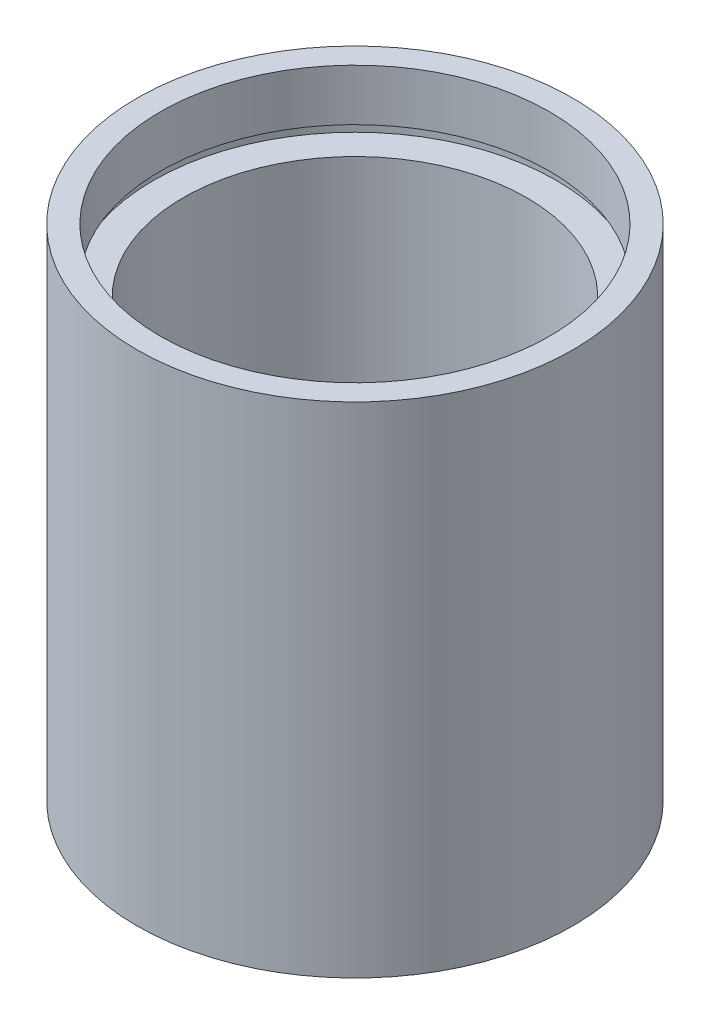
ISO-10303-21;
HEADER;
FILE_DESCRIPTION(('STEP AP214'),'2;1');
FILE_NAME('part.step','',(''),(''),'','','');
FILE_SCHEMA(('AUTOMOTIVE_DESIGN { 1 0 10303 214 1 1 1 1 }'));
ENDSEC;
DATA;
#1=APPLICATION_CONTEXT('core data for automotive mechanical design processes');
#2=APPLICATION_PROTOCOL_DEFINITION('international standard','automotive_design',2000,#1);
#3=PRODUCT_CONTEXT('',#1,'mechanical');
#4=PRODUCT('Part','Part','',(#3));
#5=PRODUCT_RELATED_PRODUCT_CATEGORY('part','',(#4));
#6=PRODUCT_DEFINITION_FORMATION('','',#4);
#7=PRODUCT_DEFINITION_CONTEXT('part definition',#1,'design');
#8=PRODUCT_DEFINITION('design','',#6,#7);
#9=PRODUCT_DEFINITION_SHAPE('','',#8);
#10=(LENGTH_UNIT() NAMED_UNIT(*) SI_UNIT(.MILLI.,.METRE.));
#11=(NAMED_UNIT(*) PLANE_ANGLE_UNIT() SI_UNIT($,.RADIAN.));
#12=(NAMED_UNIT(*) SI_UNIT($,.STERADIAN.) SOLID_ANGLE_UNIT());
#13=UNCERTAINTY_MEASURE_WITH_UNIT(LENGTH_MEASURE(1.E-05),#10,'distance_accuracy_value','');
#14=(GEOMETRIC_REPRESENTATION_CONTEXT(3) GLOBAL_UNCERTAINTY_ASSIGNED_CONTEXT((#13)) GLOBAL_UNIT_ASSIGNED_CONTEXT((#10,
#11,#12)) REPRESENTATION_CONTEXT('',''));
#15=CARTESIAN_POINT('',(0.,0.,0.));
#16=DIRECTION('',(0.,0.,1.));
#17=DIRECTION('',(1.,0.,0.));
#18=AXIS2_PLACEMENT_3D('',#15,#16,#17);
#19=CARTESIAN_POINT('',(17.,0.,0.));
#20=DIRECTION('',(0.,1.,0.));
#21=DIRECTION('',(0.,0.,1.));
#22=AXIS2_PLACEMENT_3D('',#19,#20,#21);
#23=PLANE('',#22);
#24=CARTESIAN_POINT('',(0.,0.,0.));
#25=DIRECTION('',(0.,1.,0.));
#26=DIRECTION('',(0.,0.,1.));
#27=AXIS2_PLACEMENT_3D('',#24,#25,#26);
#28=CIRCLE('',#27,19.05);
#29=CARTESIAN_POINT('',(0.,0.,19.05));
#30=VERTEX_POINT('',#29);
#31=EDGE_CURVE('E10',#30,#30,#28,.T.);
#32=ORIENTED_EDGE('',*,*,#31,.F.);
#33=EDGE_LOOP('',(#32));
#34=FACE_BOUND('',#33,.T.);
#35=CARTESIAN_POINT('',(0.,0.,0.));
#36=DIRECTION('',(0.,1.,0.));
#37=DIRECTION('',(0.,0.,1.));
#38=AXIS2_PLACEMENT_3D('',#35,#36,#37);
#39=CIRCLE('',#38,17.);
#40=CARTESIAN_POINT('',(0.,0.,17.));
#41=VERTEX_POINT('',#40);
#42=EDGE_CURVE('E77',#41,#41,#39,.T.);
#43=ORIENTED_EDGE('',*,*,#42,.T.);
#44=EDGE_LOOP('',(#43));
#45=FACE_BOUND('',#44,.T.);
#46=ADVANCED_FACE('F37',(#34,#45),#23,.F.);
#47=CARTESIAN_POINT('',(0.,161.376166943427,0.));
#48=DIRECTION('',(0.,1.,0.));
#49=DIRECTION('',(0.,0.,1.));
#50=AXIS2_PLACEMENT_3D('',#47,#48,#49);
#51=CYLINDRICAL_SURFACE('',#50,19.05);
#52=CARTESIAN_POINT('',(0.,43.6,0.));
#53=DIRECTION('',(0.,1.,0.));
#54=DIRECTION('',(0.,0.,1.));
#55=AXIS2_PLACEMENT_3D('',#52,#53,#54);
#56=CIRCLE('',#55,19.05);
#57=CARTESIAN_POINT('',(0.,43.6,19.05));
#58=VERTEX_POINT('',#57);
#59=EDGE_CURVE('E43',#58,#58,#56,.T.);
#60=ORIENTED_EDGE('',*,*,#59,.F.);
#61=EDGE_LOOP('',(#60));
#62=FACE_BOUND('',#61,.T.);
#63=ORIENTED_EDGE('',*,*,#31,.T.);
#64=EDGE_LOOP('',(#63));
#65=FACE_BOUND('',#64,.T.);
#66=ADVANCED_FACE('F138',(#62,#65),#51,.T.);
#67=CARTESIAN_POINT('',(17.,43.6,0.));
#68=DIRECTION('',(0.,-1.,0.));
#69=DIRECTION('',(0.,0.,-1.));
#70=AXIS2_PLACEMENT_3D('',#67,#68,#69);
#71=PLANE('',#70);
#72=CARTESIAN_POINT('',(0.,43.6,0.));
#73=DIRECTION('',(0.,1.,0.));
#74=DIRECTION('',(0.,0.,1.));
#75=AXIS2_PLACEMENT_3D('',#72,#73,#74);
#76=CIRCLE('',#75,17.);
#77=CARTESIAN_POINT('',(0.,43.6,17.));
#78=VERTEX_POINT('',#77);
#79=EDGE_CURVE('E47',#78,#78,#76,.T.);
#80=ORIENTED_EDGE('',*,*,#79,.F.);
#81=EDGE_LOOP('',(#80));
#82=FACE_BOUND('',#81,.T.);
#83=ORIENTED_EDGE('',*,*,#59,.T.);
#84=EDGE_LOOP('',(#83));
#85=FACE_BOUND('',#84,.T.);
#86=ADVANCED_FACE('F133',(#82,#85),#71,.F.);
#87=CARTESIAN_POINT('',(0.,161.376166943427,0.));
#88=DIRECTION('',(0.,1.,0.));
#89=DIRECTION('',(0.,0.,1.));
#90=AXIS2_PLACEMENT_3D('',#87,#88,#89);
#91=CYLINDRICAL_SURFACE('',#90,17.);
#92=CARTESIAN_POINT('',(0.,39.1,0.));
#93=DIRECTION('',(0.,1.,0.));
#94=DIRECTION('',(0.,0.,1.));
#95=AXIS2_PLACEMENT_3D('',#92,#93,#94);
#96=CIRCLE('',#95,17.);
#97=CARTESIAN_POINT('',(0.,39.1,17.));
#98=VERTEX_POINT('',#97);
#99=EDGE_CURVE('E51',#98,#98,#96,.T.);
#100=ORIENTED_EDGE('',*,*,#99,.F.);
#101=EDGE_LOOP('',(#100));
#102=FACE_BOUND('',#101,.T.);
#103=ORIENTED_EDGE('',*,*,#79,.T.);
#104=EDGE_LOOP('',(#103));
#105=FACE_BOUND('',#104,.T.);
#106=ADVANCED_FACE('F127',(#102,#105),#91,.F.);
#107=CARTESIAN_POINT('',(17.6,39.1,0.));
#108=DIRECTION('',(0.,1.,0.));
#109=DIRECTION('',(0.,0.,1.));
#110=AXIS2_PLACEMENT_3D('',#107,#108,#109);
#111=PLANE('',#110);
#112=CARTESIAN_POINT('',(0.,39.1,0.));
#113=DIRECTION('',(0.,1.,0.));
#114=DIRECTION('',(0.,0.,1.));
#115=AXIS2_PLACEMENT_3D('',#112,#113,#114);
#116=CIRCLE('',#115,17.6);
#117=CARTESIAN_POINT('',(0.,39.1,17.6));
#118=VERTEX_POINT('',#117);
#119=EDGE_CURVE('E56',#118,#118,#116,.T.);
#120=ORIENTED_EDGE('',*,*,#119,.F.);
#121=EDGE_LOOP('',(#120));
#122=FACE_BOUND('',#121,.T.);
#123=ORIENTED_EDGE('',*,*,#99,.T.);
#124=EDGE_LOOP('',(#123));
#125=FACE_BOUND('',#124,.T.);
#126=ADVANCED_FACE('F121',(#122,#125),#111,.F.);
#127=CARTESIAN_POINT('',(0.,161.376166943427,0.));
#128=DIRECTION('',(0.,1.,0.));
#129=DIRECTION('',(0.,0.,1.));
#130=AXIS2_PLACEMENT_3D('',#127,#128,#129);
#131=CYLINDRICAL_SURFACE('',#130,17.6);
#132=CARTESIAN_POINT('',(0.,38.1,0.));
#133=DIRECTION('',(0.,1.,0.));
#134=DIRECTION('',(0.,0.,1.));
#135=AXIS2_PLACEMENT_3D('',#132,#133,#134);
#136=CIRCLE('',#135,17.6);
#137=CARTESIAN_POINT('',(0.,38.1,17.6));
#138=VERTEX_POINT('',#137);
#139=EDGE_CURVE('E59',#138,#138,#136,.T.);
#140=ORIENTED_EDGE('',*,*,#139,.F.);
#141=EDGE_LOOP('',(#140));
#142=FACE_BOUND('',#141,.T.);
#143=ORIENTED_EDGE('',*,*,#119,.T.);
#144=EDGE_LOOP('',(#143));
#145=FACE_BOUND('',#144,.T.);
#146=ADVANCED_FACE('F115',(#142,#145),#131,.F.);
#147=CARTESIAN_POINT('',(15.,38.1,0.));
#148=DIRECTION('',(0.,-1.,0.));
#149=DIRECTION('',(0.,0.,-1.));
#150=AXIS2_PLACEMENT_3D('',#147,#148,#149);
#151=PLANE('',#150);
#152=CARTESIAN_POINT('',(0.,38.1,0.));
#153=DIRECTION('',(0.,1.,0.));
#154=DIRECTION('',(0.,0.,1.));
#155=AXIS2_PLACEMENT_3D('',#152,#153,#154);
#156=CIRCLE('',#155,15.);
#157=CARTESIAN_POINT('',(0.,38.1,15.));
#158=VERTEX_POINT('',#157);
#159=EDGE_CURVE('E62',#158,#158,#156,.T.);
#160=ORIENTED_EDGE('',*,*,#159,.F.);
#161=EDGE_LOOP('',(#160));
#162=FACE_BOUND('',#161,.T.);
#163=ORIENTED_EDGE('',*,*,#139,.T.);
#164=EDGE_LOOP('',(#163));
#165=FACE_BOUND('',#164,.T.);
#166=ADVANCED_FACE('F109',(#162,#165),#151,.F.);
#167=CARTESIAN_POINT('',(0.,161.376166943427,0.));
#168=DIRECTION('',(0.,1.,0.));
#169=DIRECTION('',(0.,0.,1.));
#170=AXIS2_PLACEMENT_3D('',#167,#168,#169);
#171=CYLINDRICAL_SURFACE('',#170,15.);
#172=CARTESIAN_POINT('',(0.,5.49999999999998,0.));
#173=DIRECTION('',(0.,1.,0.));
#174=DIRECTION('',(0.,0.,1.));
#175=AXIS2_PLACEMENT_3D('',#172,#173,#174);
#176=CIRCLE('',#175,15.);
#177=CARTESIAN_POINT('',(0.,5.49999999999998,15.));
#178=VERTEX_POINT('',#177);
#179=EDGE_CURVE('E65',#178,#178,#176,.T.);
#180=ORIENTED_EDGE('',*,*,#179,.F.);
#181=EDGE_LOOP('',(#180));
#182=FACE_BOUND('',#181,.T.);
#183=ORIENTED_EDGE('',*,*,#159,.T.);
#184=EDGE_LOOP('',(#183));
#185=FACE_BOUND('',#184,.T.);
#186=ADVANCED_FACE('F103',(#182,#185),#171,.F.);
#187=CARTESIAN_POINT('',(15.,5.49999999999998,0.));
#188=DIRECTION('',(0.,1.,0.));
#189=DIRECTION('',(0.,0.,1.));
#190=AXIS2_PLACEMENT_3D('',#187,#188,#189);
#191=PLANE('',#190);
#192=CARTESIAN_POINT('',(0.,5.49999999999998,0.));
#193=DIRECTION('',(0.,1.,0.));
#194=DIRECTION('',(0.,0.,1.));
#195=AXIS2_PLACEMENT_3D('',#192,#193,#194);
#196=CIRCLE('',#195,17.6);
#197=CARTESIAN_POINT('',(0.,5.49999999999998,17.6));
#198=VERTEX_POINT('',#197);
#199=EDGE_CURVE('E68',#198,#198,#196,.T.);
#200=ORIENTED_EDGE('',*,*,#199,.F.);
#201=EDGE_LOOP('',(#200));
#202=FACE_BOUND('',#201,.T.);
#203=ORIENTED_EDGE('',*,*,#179,.T.);
#204=EDGE_LOOP('',(#203));
#205=FACE_BOUND('',#204,.T.);
#206=ADVANCED_FACE('F97',(#202,#205),#191,.F.);
#207=CARTESIAN_POINT('',(0.,161.376166943427,0.));
#208=DIRECTION('',(0.,1.,0.));
#209=DIRECTION('',(0.,0.,1.));
#210=AXIS2_PLACEMENT_3D('',#207,#208,#209);
#211=CYLINDRICAL_SURFACE('',#210,17.6);
#212=CARTESIAN_POINT('',(0.,4.49999999999998,0.));
#213=DIRECTION('',(0.,1.,0.));
#214=DIRECTION('',(0.,0.,1.));
#215=AXIS2_PLACEMENT_3D('',#212,#213,#214);
#216=CIRCLE('',#215,17.6);
#217=CARTESIAN_POINT('',(0.,4.49999999999998,17.6));
#218=VERTEX_POINT('',#217);
#219=EDGE_CURVE('E71',#218,#218,#216,.T.);
#220=ORIENTED_EDGE('',*,*,#219,.F.);
#221=EDGE_LOOP('',(#220));
#222=FACE_BOUND('',#221,.T.);
#223=ORIENTED_EDGE('',*,*,#199,.T.);
#224=EDGE_LOOP('',(#223));
#225=FACE_BOUND('',#224,.T.);
#226=ADVANCED_FACE('F91',(#222,#225),#211,.F.);
#227=CARTESIAN_POINT('',(17.,4.49999999999998,0.));
#228=DIRECTION('',(0.,-1.,0.));
#229=DIRECTION('',(0.,0.,-1.));
#230=AXIS2_PLACEMENT_3D('',#227,#228,#229);
#231=PLANE('',#230);
#232=CARTESIAN_POINT('',(0.,4.49999999999998,0.));
#233=DIRECTION('',(0.,1.,0.));
#234=DIRECTION('',(0.,0.,1.));
#235=AXIS2_PLACEMENT_3D('',#232,#233,#234);
#236=CIRCLE('',#235,17.);
#237=CARTESIAN_POINT('',(0.,4.49999999999998,17.));
#238=VERTEX_POINT('',#237);
#239=EDGE_CURVE('E74',#238,#238,#236,.T.);
#240=ORIENTED_EDGE('',*,*,#239,.F.);
#241=EDGE_LOOP('',(#240));
#242=FACE_BOUND('',#241,.T.);
#243=ORIENTED_EDGE('',*,*,#219,.T.);
#244=EDGE_LOOP('',(#243));
#245=FACE_BOUND('',#244,.T.);
#246=ADVANCED_FACE('F85',(#242,#245),#231,.F.);
#247=CARTESIAN_POINT('',(0.,161.376166943427,0.));
#248=DIRECTION('',(0.,1.,0.));
#249=DIRECTION('',(0.,0.,1.));
#250=AXIS2_PLACEMENT_3D('',#247,#248,#249);
#251=CYLINDRICAL_SURFACE('',#250,17.);
#252=ORIENTED_EDGE('',*,*,#42,.F.);
#253=EDGE_LOOP('',(#252));
#254=FACE_BOUND('',#253,.T.);
#255=ORIENTED_EDGE('',*,*,#239,.T.);
#256=EDGE_LOOP('',(#255));
#257=FACE_BOUND('',#256,.T.);
#258=ADVANCED_FACE('F82',(#254,#257),#251,.F.);
#259=CLOSED_SHELL('',(#46,#66,#86,#106,#126,#146,#166,#186,#206,#226,#246,#258));
#260=MANIFOLD_SOLID_BREP('B2',#259);
#261=ADVANCED_BREP_SHAPE_REPRESENTATION('',(#18,#260),#14);
#262=SHAPE_DEFINITION_REPRESENTATION(#9,#261);
ENDSEC;
END-ISO-10303-21;
